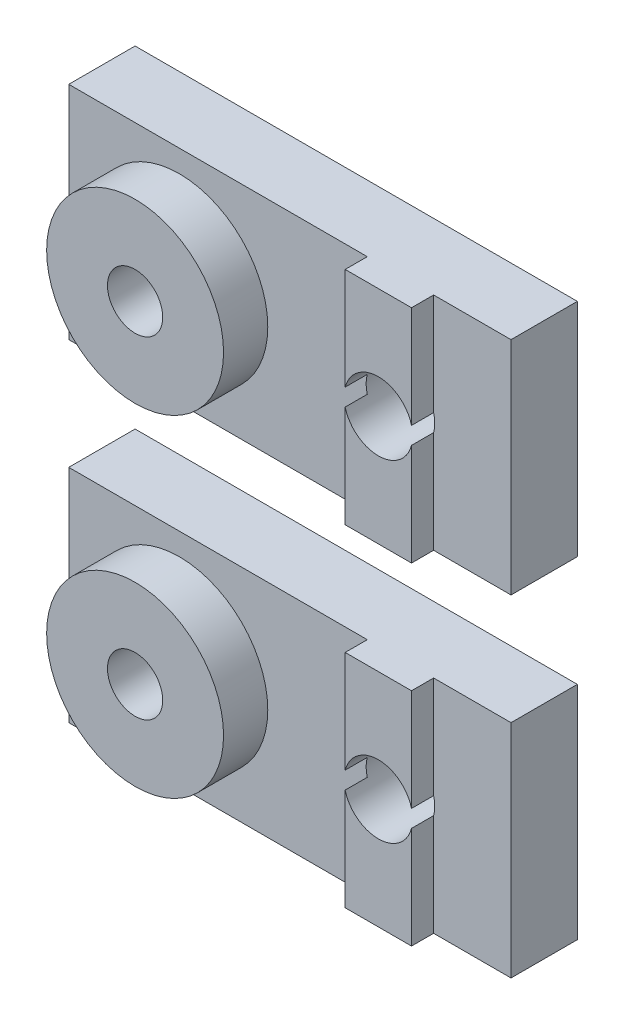
ISO-10303-21;
HEADER;
FILE_DESCRIPTION(('STEP AP214'),'2;1');
FILE_NAME('part.step','',(''),(''),'','','');
FILE_SCHEMA(('AUTOMOTIVE_DESIGN { 1 0 10303 214 1 1 1 1 }'));
ENDSEC;
DATA;
#1=APPLICATION_CONTEXT('core data for automotive mechanical design processes');
#2=APPLICATION_PROTOCOL_DEFINITION('international standard','automotive_design',2000,#1);
#3=PRODUCT_CONTEXT('',#1,'mechanical');
#4=PRODUCT('Part','Part','',(#3));
#5=PRODUCT_RELATED_PRODUCT_CATEGORY('part','',(#4));
#6=PRODUCT_DEFINITION_FORMATION('','',#4);
#7=PRODUCT_DEFINITION_CONTEXT('part definition',#1,'design');
#8=PRODUCT_DEFINITION('design','',#6,#7);
#9=PRODUCT_DEFINITION_SHAPE('','',#8);
#10=(LENGTH_UNIT() NAMED_UNIT(*) SI_UNIT(.MILLI.,.METRE.));
#11=(NAMED_UNIT(*) PLANE_ANGLE_UNIT() SI_UNIT($,.RADIAN.));
#12=(NAMED_UNIT(*) SI_UNIT($,.STERADIAN.) SOLID_ANGLE_UNIT());
#13=UNCERTAINTY_MEASURE_WITH_UNIT(LENGTH_MEASURE(1.E-05),#10,'distance_accuracy_value','');
#14=(GEOMETRIC_REPRESENTATION_CONTEXT(3) GLOBAL_UNCERTAINTY_ASSIGNED_CONTEXT((#13)) GLOBAL_UNIT_ASSIGNED_CONTEXT((#10,
#11,#12)) REPRESENTATION_CONTEXT('',''));
#15=CARTESIAN_POINT('',(0.,0.,0.));
#16=DIRECTION('',(0.,0.,1.));
#17=DIRECTION('',(1.,0.,0.));
#18=AXIS2_PLACEMENT_3D('',#15,#16,#17);
#19=CARTESIAN_POINT('',(3.5,25.,4.));
#20=DIRECTION('',(1.,0.,0.));
#21=DIRECTION('',(0.,1.,0.));
#22=AXIS2_PLACEMENT_3D('',#19,#20,#21);
#23=PLANE('',#22);
#24=DIRECTION('',(0.,0.,-1.));
#25=VECTOR('',#24,1.);
#26=CARTESIAN_POINT('',(3.5,19.6094875162047,5.));
#27=LINE('',#26,#25);
#28=CARTESIAN_POINT('',(3.5,19.6094875162047,3.));
#29=VERTEX_POINT('',#28);
#30=CARTESIAN_POINT('',(3.5,19.6094875162047,4.));
#31=VERTEX_POINT('',#30);
#32=EDGE_CURVE('E258',#29,#31,#27,.F.);
#33=ORIENTED_EDGE('',*,*,#32,.F.);
#34=DIRECTION('',(0.,-1.,0.));
#35=VECTOR('',#34,1.);
#36=CARTESIAN_POINT('',(3.5,25.,3.));
#37=LINE('',#36,#35);
#38=CARTESIAN_POINT('',(3.5,15.,3.));
#39=VERTEX_POINT('',#38);
#40=EDGE_CURVE('E169',#29,#39,#37,.T.);
#41=ORIENTED_EDGE('',*,*,#40,.T.);
#42=DIRECTION('',(0.,0.,-1.));
#43=VECTOR('',#42,1.);
#44=CARTESIAN_POINT('',(3.5,15.,4.));
#45=LINE('',#44,#43);
#46=CARTESIAN_POINT('',(3.5,15.,4.));
#47=VERTEX_POINT('',#46);
#48=EDGE_CURVE('E179',#47,#39,#45,.T.);
#49=ORIENTED_EDGE('',*,*,#48,.F.);
#50=DIRECTION('',(0.,-1.,0.));
#51=VECTOR('',#50,1.);
#52=CARTESIAN_POINT('',(3.5,25.,4.));
#53=LINE('',#52,#51);
#54=EDGE_CURVE('E154',#31,#47,#53,.T.);
#55=ORIENTED_EDGE('',*,*,#54,.F.);
#56=EDGE_LOOP('',(#33,#41,#49,#55));
#57=FACE_BOUND('',#56,.T.);
#58=ADVANCED_FACE('F43',(#57),#23,.F.);
#59=DIRECTION('',(0.,0.,-1.));
#60=VECTOR('',#59,1.);
#61=CARTESIAN_POINT('',(3.5,20.3905124837953,5.));
#62=LINE('',#61,#60);
#63=CARTESIAN_POINT('',(3.5,20.3905124837953,4.));
#64=VERTEX_POINT('',#63);
#65=CARTESIAN_POINT('',(3.5,20.3905124837953,3.));
#66=VERTEX_POINT('',#65);
#67=EDGE_CURVE('E133',#64,#66,#62,.T.);
#68=ORIENTED_EDGE('',*,*,#67,.F.);
#69=CARTESIAN_POINT('',(3.5,25.,4.));
#70=VERTEX_POINT('',#69);
#71=EDGE_CURVE('E144',#70,#64,#53,.T.);
#72=ORIENTED_EDGE('',*,*,#71,.F.);
#73=DIRECTION('',(0.,0.,-1.));
#74=VECTOR('',#73,1.);
#75=CARTESIAN_POINT('',(3.5,25.,4.));
#76=LINE('',#75,#74);
#77=CARTESIAN_POINT('',(3.5,25.,3.));
#78=VERTEX_POINT('',#77);
#79=EDGE_CURVE('E167',#70,#78,#76,.T.);
#80=ORIENTED_EDGE('',*,*,#79,.T.);
#81=EDGE_CURVE('E146',#78,#66,#37,.T.);
#82=ORIENTED_EDGE('',*,*,#81,.T.);
#83=EDGE_LOOP('',(#68,#72,#80,#82));
#84=FACE_BOUND('',#83,.T.);
#85=ADVANCED_FACE('F142',(#84),#23,.F.);
#86=CARTESIAN_POINT('',(6.5,25.,4.));
#87=DIRECTION('',(-1.,0.,0.));
#88=DIRECTION('',(0.,0.,1.));
#89=AXIS2_PLACEMENT_3D('',#86,#87,#88);
#90=PLANE('',#89);
#91=DIRECTION('',(0.,0.,-1.));
#92=VECTOR('',#91,1.);
#93=CARTESIAN_POINT('',(6.5,20.3905124837953,5.));
#94=LINE('',#93,#92);
#95=CARTESIAN_POINT('',(6.5,20.3905124837953,3.));
#96=VERTEX_POINT('',#95);
#97=CARTESIAN_POINT('',(6.5,20.3905124837953,4.));
#98=VERTEX_POINT('',#97);
#99=EDGE_CURVE('E58',#96,#98,#94,.F.);
#100=ORIENTED_EDGE('',*,*,#99,.F.);
#101=DIRECTION('',(0.,1.,0.));
#102=VECTOR('',#101,1.);
#103=CARTESIAN_POINT('',(6.5,25.,3.));
#104=LINE('',#103,#102);
#105=CARTESIAN_POINT('',(6.5,25.,3.));
#106=VERTEX_POINT('',#105);
#107=EDGE_CURVE('E65',#96,#106,#104,.T.);
#108=ORIENTED_EDGE('',*,*,#107,.T.);
#109=DIRECTION('',(0.,0.,-1.));
#110=VECTOR('',#109,1.);
#111=CARTESIAN_POINT('',(6.5,25.,4.));
#112=LINE('',#111,#110);
#113=CARTESIAN_POINT('',(6.5,25.,4.));
#114=VERTEX_POINT('',#113);
#115=EDGE_CURVE('E173',#114,#106,#112,.T.);
#116=ORIENTED_EDGE('',*,*,#115,.F.);
#117=DIRECTION('',(0.,1.,0.));
#118=VECTOR('',#117,1.);
#119=CARTESIAN_POINT('',(6.5,25.,4.));
#120=LINE('',#119,#118);
#121=EDGE_CURVE('E156',#98,#114,#120,.T.);
#122=ORIENTED_EDGE('',*,*,#121,.F.);
#123=EDGE_LOOP('',(#100,#108,#116,#122));
#124=FACE_BOUND('',#123,.T.);
#125=ADVANCED_FACE('F290',(#124),#90,.F.);
#126=DIRECTION('',(0.,0.,-1.));
#127=VECTOR('',#126,1.);
#128=CARTESIAN_POINT('',(6.5,19.6094875162047,5.));
#129=LINE('',#128,#127);
#130=CARTESIAN_POINT('',(6.5,19.6094875162047,4.));
#131=VERTEX_POINT('',#130);
#132=CARTESIAN_POINT('',(6.5,19.6094875162047,3.));
#133=VERTEX_POINT('',#132);
#134=EDGE_CURVE('E250',#131,#133,#129,.T.);
#135=ORIENTED_EDGE('',*,*,#134,.F.);
#136=CARTESIAN_POINT('',(6.5,15.,4.));
#137=VERTEX_POINT('',#136);
#138=EDGE_CURVE('E163',#137,#131,#120,.T.);
#139=ORIENTED_EDGE('',*,*,#138,.F.);
#140=DIRECTION('',(0.,0.,-1.));
#141=VECTOR('',#140,1.);
#142=CARTESIAN_POINT('',(6.5,15.,4.));
#143=LINE('',#142,#141);
#144=CARTESIAN_POINT('',(6.5,15.,3.));
#145=VERTEX_POINT('',#144);
#146=EDGE_CURVE('E176',#137,#145,#143,.T.);
#147=ORIENTED_EDGE('',*,*,#146,.T.);
#148=EDGE_CURVE('E158',#145,#133,#104,.T.);
#149=ORIENTED_EDGE('',*,*,#148,.T.);
#150=EDGE_LOOP('',(#135,#139,#147,#149));
#151=FACE_BOUND('',#150,.T.);
#152=ADVANCED_FACE('F249',(#151),#90,.F.);
#153=CARTESIAN_POINT('',(0.,15.,4.));
#154=DIRECTION('',(0.,0.,1.));
#155=DIRECTION('',(1.,0.,0.));
#156=AXIS2_PLACEMENT_3D('',#153,#154,#155);
#157=PLANE('',#156);
#158=ORIENTED_EDGE('',*,*,#138,.T.);
#159=CARTESIAN_POINT('',(5.,20.,4.));
#160=DIRECTION('',(0.,0.,1.));
#161=DIRECTION('',(1.,0.,0.));
#162=AXIS2_PLACEMENT_3D('',#159,#160,#161);
#163=CIRCLE('',#162,1.55);
#164=EDGE_CURVE('E12',#131,#31,#163,.F.);
#165=ORIENTED_EDGE('',*,*,#164,.T.);
#166=ORIENTED_EDGE('',*,*,#54,.T.);
#167=DIRECTION('',(1.,0.,0.));
#168=VECTOR('',#167,1.);
#169=CARTESIAN_POINT('',(3.5,15.,4.));
#170=LINE('',#169,#168);
#171=EDGE_CURVE('E153',#47,#137,#170,.T.);
#172=ORIENTED_EDGE('',*,*,#171,.T.);
#173=EDGE_LOOP('',(#158,#165,#166,#172));
#174=FACE_BOUND('',#173,.T.);
#175=ADVANCED_FACE('F252',(#174),#157,.T.);
#176=CARTESIAN_POINT('',(0.,15.,3.));
#177=DIRECTION('',(0.,0.,1.));
#178=DIRECTION('',(1.,0.,0.));
#179=AXIS2_PLACEMENT_3D('',#176,#177,#178);
#180=PLANE('',#179);
#181=CARTESIAN_POINT('',(-5.,20.,3.));
#182=DIRECTION('',(0.,0.,1.));
#183=DIRECTION('',(1.,0.,0.));
#184=AXIS2_PLACEMENT_3D('',#181,#182,#183);
#185=CIRCLE('',#184,4.);
#186=CARTESIAN_POINT('',(-1.,20.,3.));
#187=VERTEX_POINT('',#186);
#188=EDGE_CURVE('E185',#187,#187,#185,.T.);
#189=ORIENTED_EDGE('',*,*,#188,.F.);
#190=EDGE_LOOP('',(#189));
#191=FACE_BOUND('',#190,.T.);
#192=ORIENTED_EDGE('',*,*,#40,.F.);
#193=CARTESIAN_POINT('',(5.,20.,3.));
#194=DIRECTION('',(0.,0.,1.));
#195=DIRECTION('',(1.,0.,0.));
#196=AXIS2_PLACEMENT_3D('',#193,#194,#195);
#197=CIRCLE('',#196,1.55);
#198=EDGE_CURVE('E261',#29,#66,#197,.F.);
#199=ORIENTED_EDGE('',*,*,#198,.T.);
#200=ORIENTED_EDGE('',*,*,#81,.F.);
#201=DIRECTION('',(-1.,0.,0.));
#202=VECTOR('',#201,1.);
#203=CARTESIAN_POINT('',(-10.,25.,3.));
#204=LINE('',#203,#202);
#205=CARTESIAN_POINT('',(-10.,25.,3.));
#206=VERTEX_POINT('',#205);
#207=EDGE_CURVE('E202',#78,#206,#204,.T.);
#208=ORIENTED_EDGE('',*,*,#207,.T.);
#209=DIRECTION('',(0.,-1.,0.));
#210=VECTOR('',#209,1.);
#211=CARTESIAN_POINT('',(-10.,25.,3.));
#212=LINE('',#211,#210);
#213=CARTESIAN_POINT('',(-10.,15.,3.));
#214=VERTEX_POINT('',#213);
#215=EDGE_CURVE('E192',#206,#214,#212,.T.);
#216=ORIENTED_EDGE('',*,*,#215,.T.);
#217=DIRECTION('',(1.,0.,0.));
#218=VECTOR('',#217,1.);
#219=CARTESIAN_POINT('',(-10.,15.,3.));
#220=LINE('',#219,#218);
#221=EDGE_CURVE('E197',#214,#39,#220,.T.);
#222=ORIENTED_EDGE('',*,*,#221,.T.);
#223=EDGE_LOOP('',(#192,#199,#200,#208,#216,#222));
#224=FACE_BOUND('',#223,.T.);
#225=ADVANCED_FACE('F260',(#191,#224),#180,.T.);
#226=ORIENTED_EDGE('',*,*,#107,.F.);
#227=CARTESIAN_POINT('',(5.,20.,3.));
#228=DIRECTION('',(0.,0.,1.));
#229=DIRECTION('',(1.,0.,0.));
#230=AXIS2_PLACEMENT_3D('',#227,#228,#229);
#231=CIRCLE('',#230,1.55);
#232=EDGE_CURVE('E147',#96,#133,#231,.F.);
#233=ORIENTED_EDGE('',*,*,#232,.T.);
#234=ORIENTED_EDGE('',*,*,#148,.F.);
#235=CARTESIAN_POINT('',(10.,15.,3.));
#236=VERTEX_POINT('',#235);
#237=EDGE_CURVE('E195',#145,#236,#220,.T.);
#238=ORIENTED_EDGE('',*,*,#237,.T.);
#239=DIRECTION('',(0.,1.,0.));
#240=VECTOR('',#239,1.);
#241=CARTESIAN_POINT('',(10.,25.,3.));
#242=LINE('',#241,#240);
#243=CARTESIAN_POINT('',(10.,25.,3.));
#244=VERTEX_POINT('',#243);
#245=EDGE_CURVE('E200',#236,#244,#242,.T.);
#246=ORIENTED_EDGE('',*,*,#245,.T.);
#247=EDGE_CURVE('E203',#244,#106,#204,.T.);
#248=ORIENTED_EDGE('',*,*,#247,.T.);
#249=EDGE_LOOP('',(#226,#233,#234,#238,#246,#248));
#250=FACE_BOUND('',#249,.T.);
#251=ADVANCED_FACE('F241',(#250),#180,.T.);
#252=CARTESIAN_POINT('',(-10.,25.,3.));
#253=DIRECTION('',(1.,0.,0.));
#254=DIRECTION('',(0.,1.,0.));
#255=AXIS2_PLACEMENT_3D('',#252,#253,#254);
#256=PLANE('',#255);
#257=DIRECTION('',(0.,-1.,0.));
#258=VECTOR('',#257,1.);
#259=CARTESIAN_POINT('',(-10.,25.,0.));
#260=LINE('',#259,#258);
#261=CARTESIAN_POINT('',(-10.,25.,0.));
#262=VERTEX_POINT('',#261);
#263=CARTESIAN_POINT('',(-10.,15.,0.));
#264=VERTEX_POINT('',#263);
#265=EDGE_CURVE('E189',#262,#264,#260,.T.);
#266=ORIENTED_EDGE('',*,*,#265,.T.);
#267=DIRECTION('',(0.,0.,-1.));
#268=VECTOR('',#267,1.);
#269=CARTESIAN_POINT('',(-10.,15.,3.));
#270=LINE('',#269,#268);
#271=EDGE_CURVE('E138',#214,#264,#270,.T.);
#272=ORIENTED_EDGE('',*,*,#271,.F.);
#273=ORIENTED_EDGE('',*,*,#215,.F.);
#274=DIRECTION('',(0.,0.,-1.));
#275=VECTOR('',#274,1.);
#276=CARTESIAN_POINT('',(-10.,25.,3.));
#277=LINE('',#276,#275);
#278=EDGE_CURVE('E205',#206,#262,#277,.T.);
#279=ORIENTED_EDGE('',*,*,#278,.T.);
#280=EDGE_LOOP('',(#266,#272,#273,#279));
#281=FACE_BOUND('',#280,.T.);
#282=ADVANCED_FACE('F45',(#281),#256,.F.);
#283=CARTESIAN_POINT('',(-10.,15.,3.));
#284=DIRECTION('',(0.,1.,0.));
#285=DIRECTION('',(-1.,0.,0.));
#286=AXIS2_PLACEMENT_3D('',#283,#284,#285);
#287=PLANE('',#286);
#288=DIRECTION('',(1.,0.,0.));
#289=VECTOR('',#288,1.);
#290=CARTESIAN_POINT('',(-10.,15.,0.));
#291=LINE('',#290,#289);
#292=CARTESIAN_POINT('',(10.,15.,0.));
#293=VERTEX_POINT('',#292);
#294=EDGE_CURVE('E208',#264,#293,#291,.T.);
#295=ORIENTED_EDGE('',*,*,#294,.T.);
#296=DIRECTION('',(0.,0.,-1.));
#297=VECTOR('',#296,1.);
#298=CARTESIAN_POINT('',(10.,15.,3.));
#299=LINE('',#298,#297);
#300=EDGE_CURVE('E218',#236,#293,#299,.T.);
#301=ORIENTED_EDGE('',*,*,#300,.F.);
#302=ORIENTED_EDGE('',*,*,#237,.F.);
#303=ORIENTED_EDGE('',*,*,#146,.F.);
#304=ORIENTED_EDGE('',*,*,#171,.F.);
#305=ORIENTED_EDGE('',*,*,#48,.T.);
#306=ORIENTED_EDGE('',*,*,#221,.F.);
#307=ORIENTED_EDGE('',*,*,#271,.T.);
#308=EDGE_LOOP('',(#295,#301,#302,#303,#304,#305,#306,#307));
#309=FACE_BOUND('',#308,.T.);
#310=ADVANCED_FACE('F223',(#309),#287,.F.);
#311=CARTESIAN_POINT('',(10.,25.,3.));
#312=DIRECTION('',(-1.,0.,0.));
#313=DIRECTION('',(0.,0.,1.));
#314=AXIS2_PLACEMENT_3D('',#311,#312,#313);
#315=PLANE('',#314);
#316=DIRECTION('',(0.,1.,0.));
#317=VECTOR('',#316,1.);
#318=CARTESIAN_POINT('',(10.,25.,0.));
#319=LINE('',#318,#317);
#320=CARTESIAN_POINT('',(10.,25.,0.));
#321=VERTEX_POINT('',#320);
#322=EDGE_CURVE('E210',#293,#321,#319,.T.);
#323=ORIENTED_EDGE('',*,*,#322,.T.);
#324=DIRECTION('',(0.,0.,-1.));
#325=VECTOR('',#324,1.);
#326=CARTESIAN_POINT('',(10.,25.,3.));
#327=LINE('',#326,#325);
#328=EDGE_CURVE('E215',#244,#321,#327,.T.);
#329=ORIENTED_EDGE('',*,*,#328,.F.);
#330=ORIENTED_EDGE('',*,*,#245,.F.);
#331=ORIENTED_EDGE('',*,*,#300,.T.);
#332=EDGE_LOOP('',(#323,#329,#330,#331));
#333=FACE_BOUND('',#332,.T.);
#334=ADVANCED_FACE('F235',(#333),#315,.F.);
#335=CARTESIAN_POINT('',(-10.,25.,3.));
#336=DIRECTION('',(0.,-1.,0.));
#337=DIRECTION('',(1.,0.,0.));
#338=AXIS2_PLACEMENT_3D('',#335,#336,#337);
#339=PLANE('',#338);
#340=DIRECTION('',(-1.,0.,0.));
#341=VECTOR('',#340,1.);
#342=CARTESIAN_POINT('',(-10.,25.,0.));
#343=LINE('',#342,#341);
#344=EDGE_CURVE('E196',#321,#262,#343,.T.);
#345=ORIENTED_EDGE('',*,*,#344,.T.);
#346=ORIENTED_EDGE('',*,*,#278,.F.);
#347=ORIENTED_EDGE('',*,*,#207,.F.);
#348=ORIENTED_EDGE('',*,*,#79,.F.);
#349=DIRECTION('',(-1.,0.,0.));
#350=VECTOR('',#349,1.);
#351=CARTESIAN_POINT('',(3.5,25.,4.));
#352=LINE('',#351,#350);
#353=EDGE_CURVE('E151',#114,#70,#352,.T.);
#354=ORIENTED_EDGE('',*,*,#353,.F.);
#355=ORIENTED_EDGE('',*,*,#115,.T.);
#356=ORIENTED_EDGE('',*,*,#247,.F.);
#357=ORIENTED_EDGE('',*,*,#328,.T.);
#358=EDGE_LOOP('',(#345,#346,#347,#348,#354,#355,#356,#357));
#359=FACE_BOUND('',#358,.T.);
#360=ADVANCED_FACE('F239',(#359),#339,.F.);
#361=CARTESIAN_POINT('',(0.,15.,0.));
#362=DIRECTION('',(0.,0.,1.));
#363=DIRECTION('',(1.,0.,0.));
#364=AXIS2_PLACEMENT_3D('',#361,#362,#363);
#365=PLANE('',#364);
#366=CARTESIAN_POINT('',(5.,20.,0.));
#367=DIRECTION('',(0.,0.,1.));
#368=DIRECTION('',(1.,0.,0.));
#369=AXIS2_PLACEMENT_3D('',#366,#367,#368);
#370=CIRCLE('',#369,1.55);
#371=CARTESIAN_POINT('',(6.55,20.,0.));
#372=VERTEX_POINT('',#371);
#373=EDGE_CURVE('E417',#372,#372,#370,.T.);
#374=ORIENTED_EDGE('',*,*,#373,.T.);
#375=EDGE_LOOP('',(#374));
#376=FACE_BOUND('',#375,.T.);
#377=CARTESIAN_POINT('',(-5.,20.,0.));
#378=DIRECTION('',(0.,0.,1.));
#379=DIRECTION('',(1.,0.,0.));
#380=AXIS2_PLACEMENT_3D('',#377,#378,#379);
#381=CIRCLE('',#380,1.25);
#382=CARTESIAN_POINT('',(-3.75,20.,0.));
#383=VERTEX_POINT('',#382);
#384=EDGE_CURVE('E160',#383,#383,#381,.T.);
#385=ORIENTED_EDGE('',*,*,#384,.T.);
#386=EDGE_LOOP('',(#385));
#387=FACE_BOUND('',#386,.T.);
#388=ORIENTED_EDGE('',*,*,#265,.F.);
#389=ORIENTED_EDGE('',*,*,#344,.F.);
#390=ORIENTED_EDGE('',*,*,#322,.F.);
#391=ORIENTED_EDGE('',*,*,#294,.F.);
#392=EDGE_LOOP('',(#388,#389,#390,#391));
#393=FACE_BOUND('',#392,.T.);
#394=ADVANCED_FACE('F231',(#376,#387,#393),#365,.F.);
#395=CARTESIAN_POINT('',(-5.,20.,5.));
#396=DIRECTION('',(0.,0.,1.));
#397=DIRECTION('',(1.,0.,0.));
#398=AXIS2_PLACEMENT_3D('',#395,#396,#397);
#399=PLANE('',#398);
#400=CARTESIAN_POINT('',(-5.,20.,5.));
#401=DIRECTION('',(0.,0.,1.));
#402=DIRECTION('',(1.,0.,0.));
#403=AXIS2_PLACEMENT_3D('',#400,#401,#402);
#404=CIRCLE('',#403,4.);
#405=CARTESIAN_POINT('',(-1.,20.,5.));
#406=VERTEX_POINT('',#405);
#407=EDGE_CURVE('E186',#406,#406,#404,.T.);
#408=ORIENTED_EDGE('',*,*,#407,.T.);
#409=EDGE_LOOP('',(#408));
#410=FACE_BOUND('',#409,.T.);
#411=CARTESIAN_POINT('',(-5.,20.,5.));
#412=DIRECTION('',(0.,0.,1.));
#413=DIRECTION('',(1.,0.,0.));
#414=AXIS2_PLACEMENT_3D('',#411,#412,#413);
#415=CIRCLE('',#414,1.25);
#416=CARTESIAN_POINT('',(-3.75,20.,5.));
#417=VERTEX_POINT('',#416);
#418=EDGE_CURVE('E182',#417,#417,#415,.T.);
#419=ORIENTED_EDGE('',*,*,#418,.F.);
#420=EDGE_LOOP('',(#419));
#421=FACE_BOUND('',#420,.T.);
#422=ADVANCED_FACE('F280',(#410,#421),#399,.T.);
#423=CARTESIAN_POINT('',(-5.,20.,5.));
#424=DIRECTION('',(0.,0.,-1.));
#425=DIRECTION('',(-1.,0.,0.));
#426=AXIS2_PLACEMENT_3D('',#423,#424,#425);
#427=CYLINDRICAL_SURFACE('',#426,4.);
#428=ORIENTED_EDGE('',*,*,#407,.F.);
#429=EDGE_LOOP('',(#428));
#430=FACE_BOUND('',#429,.T.);
#431=ORIENTED_EDGE('',*,*,#188,.T.);
#432=EDGE_LOOP('',(#431));
#433=FACE_BOUND('',#432,.T.);
#434=ADVANCED_FACE('F271',(#430,#433),#427,.T.);
#435=CARTESIAN_POINT('',(-5.,20.,5.));
#436=DIRECTION('',(0.,0.,-1.));
#437=DIRECTION('',(-1.,0.,0.));
#438=AXIS2_PLACEMENT_3D('',#435,#436,#437);
#439=CYLINDRICAL_SURFACE('',#438,1.25);
#440=ORIENTED_EDGE('',*,*,#418,.T.);
#441=EDGE_LOOP('',(#440));
#442=FACE_BOUND('',#441,.T.);
#443=ORIENTED_EDGE('',*,*,#384,.F.);
#444=EDGE_LOOP('',(#443));
#445=FACE_BOUND('',#444,.T.);
#446=ADVANCED_FACE('F269',(#442,#445),#439,.F.);
#447=ORIENTED_EDGE('',*,*,#71,.T.);
#448=EDGE_CURVE('E47',#64,#98,#163,.F.);
#449=ORIENTED_EDGE('',*,*,#448,.T.);
#450=ORIENTED_EDGE('',*,*,#121,.T.);
#451=ORIENTED_EDGE('',*,*,#353,.T.);
#452=EDGE_LOOP('',(#447,#449,#450,#451));
#453=FACE_BOUND('',#452,.T.);
#454=ADVANCED_FACE('F149',(#453),#157,.T.);
#455=CARTESIAN_POINT('',(5.,20.,5.));
#456=DIRECTION('',(0.,0.,-1.));
#457=DIRECTION('',(-1.,0.,0.));
#458=AXIS2_PLACEMENT_3D('',#455,#456,#457);
#459=CYLINDRICAL_SURFACE('',#458,1.55);
#460=ORIENTED_EDGE('',*,*,#134,.T.);
#461=ORIENTED_EDGE('',*,*,#232,.F.);
#462=ORIENTED_EDGE('',*,*,#99,.T.);
#463=ORIENTED_EDGE('',*,*,#448,.F.);
#464=ORIENTED_EDGE('',*,*,#67,.T.);
#465=ORIENTED_EDGE('',*,*,#198,.F.);
#466=ORIENTED_EDGE('',*,*,#32,.T.);
#467=ORIENTED_EDGE('',*,*,#164,.F.);
#468=EDGE_LOOP('',(#460,#461,#462,#463,#464,#465,#466,#467));
#469=FACE_BOUND('',#468,.T.);
#470=ORIENTED_EDGE('',*,*,#373,.F.);
#471=EDGE_LOOP('',(#470));
#472=FACE_BOUND('',#471,.T.);
#473=ADVANCED_FACE('F131',(#469,#472),#459,.F.);
#474=CLOSED_SHELL('',(#58,#85,#125,#152,#175,#225,#251,#282,#310,#334,#360,#394,#422,#434,#446,
#454,#473));
#475=MANIFOLD_SOLID_BREP('B2',#474);
#476=CARTESIAN_POINT('',(3.5,10.,4.));
#477=DIRECTION('',(1.,0.,0.));
#478=DIRECTION('',(0.,1.,0.));
#479=AXIS2_PLACEMENT_3D('',#476,#477,#478);
#480=PLANE('',#479);
#481=DIRECTION('',(0.,0.,-1.));
#482=VECTOR('',#481,1.);
#483=CARTESIAN_POINT('',(3.5,4.60948751620466,5.));
#484=LINE('',#483,#482);
#485=CARTESIAN_POINT('',(3.5,4.60948751620466,3.));
#486=VERTEX_POINT('',#485);
#487=CARTESIAN_POINT('',(3.5,4.60948751620466,4.));
#488=VERTEX_POINT('',#487);
#489=EDGE_CURVE('E645',#486,#488,#484,.F.);
#490=ORIENTED_EDGE('',*,*,#489,.F.);
#491=DIRECTION('',(0.,-1.,0.));
#492=VECTOR('',#491,1.);
#493=CARTESIAN_POINT('',(3.5,10.,3.));
#494=LINE('',#493,#492);
#495=CARTESIAN_POINT('',(3.5,0.,3.));
#496=VERTEX_POINT('',#495);
#497=EDGE_CURVE('E556',#486,#496,#494,.T.);
#498=ORIENTED_EDGE('',*,*,#497,.T.);
#499=DIRECTION('',(0.,0.,-1.));
#500=VECTOR('',#499,1.);
#501=CARTESIAN_POINT('',(3.5,0.,4.));
#502=LINE('',#501,#500);
#503=CARTESIAN_POINT('',(3.5,0.,4.));
#504=VERTEX_POINT('',#503);
#505=EDGE_CURVE('E566',#504,#496,#502,.T.);
#506=ORIENTED_EDGE('',*,*,#505,.F.);
#507=DIRECTION('',(0.,-1.,0.));
#508=VECTOR('',#507,1.);
#509=CARTESIAN_POINT('',(3.5,10.,4.));
#510=LINE('',#509,#508);
#511=EDGE_CURVE('E541',#488,#504,#510,.T.);
#512=ORIENTED_EDGE('',*,*,#511,.F.);
#513=EDGE_LOOP('',(#490,#498,#506,#512));
#514=FACE_BOUND('',#513,.T.);
#515=ADVANCED_FACE('F430',(#514),#480,.F.);
#516=DIRECTION('',(0.,0.,-1.));
#517=VECTOR('',#516,1.);
#518=CARTESIAN_POINT('',(3.5,5.39051248379534,5.));
#519=LINE('',#518,#517);
#520=CARTESIAN_POINT('',(3.5,5.39051248379534,4.));
#521=VERTEX_POINT('',#520);
#522=CARTESIAN_POINT('',(3.5,5.39051248379534,3.));
#523=VERTEX_POINT('',#522);
#524=EDGE_CURVE('E520',#521,#523,#519,.T.);
#525=ORIENTED_EDGE('',*,*,#524,.F.);
#526=CARTESIAN_POINT('',(3.5,10.,4.));
#527=VERTEX_POINT('',#526);
#528=EDGE_CURVE('E531',#527,#521,#510,.T.);
#529=ORIENTED_EDGE('',*,*,#528,.F.);
#530=DIRECTION('',(0.,0.,-1.));
#531=VECTOR('',#530,1.);
#532=CARTESIAN_POINT('',(3.5,10.,4.));
#533=LINE('',#532,#531);
#534=CARTESIAN_POINT('',(3.5,10.,3.));
#535=VERTEX_POINT('',#534);
#536=EDGE_CURVE('E554',#527,#535,#533,.T.);
#537=ORIENTED_EDGE('',*,*,#536,.T.);
#538=EDGE_CURVE('E533',#535,#523,#494,.T.);
#539=ORIENTED_EDGE('',*,*,#538,.T.);
#540=EDGE_LOOP('',(#525,#529,#537,#539));
#541=FACE_BOUND('',#540,.T.);
#542=ADVANCED_FACE('F529',(#541),#480,.F.);
#543=CARTESIAN_POINT('',(6.5,10.,4.));
#544=DIRECTION('',(-1.,0.,0.));
#545=DIRECTION('',(0.,0.,1.));
#546=AXIS2_PLACEMENT_3D('',#543,#544,#545);
#547=PLANE('',#546);
#548=DIRECTION('',(0.,0.,-1.));
#549=VECTOR('',#548,1.);
#550=CARTESIAN_POINT('',(6.5,5.39051248379533,5.));
#551=LINE('',#550,#549);
#552=CARTESIAN_POINT('',(6.5,5.39051248379533,3.));
#553=VERTEX_POINT('',#552);
#554=CARTESIAN_POINT('',(6.5,5.39051248379533,4.));
#555=VERTEX_POINT('',#554);
#556=EDGE_CURVE('E445',#553,#555,#551,.F.);
#557=ORIENTED_EDGE('',*,*,#556,.F.);
#558=DIRECTION('',(0.,1.,0.));
#559=VECTOR('',#558,1.);
#560=CARTESIAN_POINT('',(6.5,10.,3.));
#561=LINE('',#560,#559);
#562=CARTESIAN_POINT('',(6.5,10.,3.));
#563=VERTEX_POINT('',#562);
#564=EDGE_CURVE('E452',#553,#563,#561,.T.);
#565=ORIENTED_EDGE('',*,*,#564,.T.);
#566=DIRECTION('',(0.,0.,-1.));
#567=VECTOR('',#566,1.);
#568=CARTESIAN_POINT('',(6.5,10.,4.));
#569=LINE('',#568,#567);
#570=CARTESIAN_POINT('',(6.5,10.,4.));
#571=VERTEX_POINT('',#570);
#572=EDGE_CURVE('E560',#571,#563,#569,.T.);
#573=ORIENTED_EDGE('',*,*,#572,.F.);
#574=DIRECTION('',(0.,1.,0.));
#575=VECTOR('',#574,1.);
#576=CARTESIAN_POINT('',(6.5,10.,4.));
#577=LINE('',#576,#575);
#578=EDGE_CURVE('E543',#555,#571,#577,.T.);
#579=ORIENTED_EDGE('',*,*,#578,.F.);
#580=EDGE_LOOP('',(#557,#565,#573,#579));
#581=FACE_BOUND('',#580,.T.);
#582=ADVANCED_FACE('F677',(#581),#547,.F.);
#583=DIRECTION('',(0.,0.,-1.));
#584=VECTOR('',#583,1.);
#585=CARTESIAN_POINT('',(6.5,4.60948751620467,5.));
#586=LINE('',#585,#584);
#587=CARTESIAN_POINT('',(6.5,4.60948751620467,4.));
#588=VERTEX_POINT('',#587);
#589=CARTESIAN_POINT('',(6.5,4.60948751620467,3.));
#590=VERTEX_POINT('',#589);
#591=EDGE_CURVE('E637',#588,#590,#586,.T.);
#592=ORIENTED_EDGE('',*,*,#591,.F.);
#593=CARTESIAN_POINT('',(6.5,0.,4.));
#594=VERTEX_POINT('',#593);
#595=EDGE_CURVE('E550',#594,#588,#577,.T.);
#596=ORIENTED_EDGE('',*,*,#595,.F.);
#597=DIRECTION('',(0.,0.,-1.));
#598=VECTOR('',#597,1.);
#599=CARTESIAN_POINT('',(6.5,0.,4.));
#600=LINE('',#599,#598);
#601=CARTESIAN_POINT('',(6.5,0.,3.));
#602=VERTEX_POINT('',#601);
#603=EDGE_CURVE('E563',#594,#602,#600,.T.);
#604=ORIENTED_EDGE('',*,*,#603,.T.);
#605=EDGE_CURVE('E545',#602,#590,#561,.T.);
#606=ORIENTED_EDGE('',*,*,#605,.T.);
#607=EDGE_LOOP('',(#592,#596,#604,#606));
#608=FACE_BOUND('',#607,.T.);
#609=ADVANCED_FACE('F636',(#608),#547,.F.);
#610=CARTESIAN_POINT('',(0.,0.,4.));
#611=DIRECTION('',(0.,0.,1.));
#612=DIRECTION('',(1.,0.,0.));
#613=AXIS2_PLACEMENT_3D('',#610,#611,#612);
#614=PLANE('',#613);
#615=ORIENTED_EDGE('',*,*,#595,.T.);
#616=CARTESIAN_POINT('',(5.,5.,4.));
#617=DIRECTION('',(0.,0.,1.));
#618=DIRECTION('',(1.,0.,0.));
#619=AXIS2_PLACEMENT_3D('',#616,#617,#618);
#620=CIRCLE('',#619,1.55);
#621=EDGE_CURVE('E41',#588,#488,#620,.F.);
#622=ORIENTED_EDGE('',*,*,#621,.T.);
#623=ORIENTED_EDGE('',*,*,#511,.T.);
#624=DIRECTION('',(1.,0.,0.));
#625=VECTOR('',#624,1.);
#626=CARTESIAN_POINT('',(3.5,0.,4.));
#627=LINE('',#626,#625);
#628=EDGE_CURVE('E540',#504,#594,#627,.T.);
#629=ORIENTED_EDGE('',*,*,#628,.T.);
#630=EDGE_LOOP('',(#615,#622,#623,#629));
#631=FACE_BOUND('',#630,.T.);
#632=ADVANCED_FACE('F639',(#631),#614,.T.);
#633=CARTESIAN_POINT('',(0.,0.,3.));
#634=DIRECTION('',(0.,0.,1.));
#635=DIRECTION('',(1.,0.,0.));
#636=AXIS2_PLACEMENT_3D('',#633,#634,#635);
#637=PLANE('',#636);
#638=CARTESIAN_POINT('',(-5.,5.,3.));
#639=DIRECTION('',(0.,0.,1.));
#640=DIRECTION('',(1.,0.,0.));
#641=AXIS2_PLACEMENT_3D('',#638,#639,#640);
#642=CIRCLE('',#641,4.);
#643=CARTESIAN_POINT('',(-1.,5.,3.));
#644=VERTEX_POINT('',#643);
#645=EDGE_CURVE('E572',#644,#644,#642,.T.);
#646=ORIENTED_EDGE('',*,*,#645,.F.);
#647=EDGE_LOOP('',(#646));
#648=FACE_BOUND('',#647,.T.);
#649=ORIENTED_EDGE('',*,*,#497,.F.);
#650=CARTESIAN_POINT('',(5.,5.,3.));
#651=DIRECTION('',(0.,0.,1.));
#652=DIRECTION('',(1.,0.,0.));
#653=AXIS2_PLACEMENT_3D('',#650,#651,#652);
#654=CIRCLE('',#653,1.55);
#655=EDGE_CURVE('E648',#486,#523,#654,.F.);
#656=ORIENTED_EDGE('',*,*,#655,.T.);
#657=ORIENTED_EDGE('',*,*,#538,.F.);
#658=DIRECTION('',(-1.,0.,0.));
#659=VECTOR('',#658,1.);
#660=CARTESIAN_POINT('',(-10.,10.,3.));
#661=LINE('',#660,#659);
#662=CARTESIAN_POINT('',(-10.,10.,3.));
#663=VERTEX_POINT('',#662);
#664=EDGE_CURVE('E589',#535,#663,#661,.T.);
#665=ORIENTED_EDGE('',*,*,#664,.T.);
#666=DIRECTION('',(0.,-1.,0.));
#667=VECTOR('',#666,1.);
#668=CARTESIAN_POINT('',(-10.,10.,3.));
#669=LINE('',#668,#667);
#670=CARTESIAN_POINT('',(-10.,0.,3.));
#671=VERTEX_POINT('',#670);
#672=EDGE_CURVE('E579',#663,#671,#669,.T.);
#673=ORIENTED_EDGE('',*,*,#672,.T.);
#674=DIRECTION('',(1.,0.,0.));
#675=VECTOR('',#674,1.);
#676=CARTESIAN_POINT('',(-10.,0.,3.));
#677=LINE('',#676,#675);
#678=EDGE_CURVE('E584',#671,#496,#677,.T.);
#679=ORIENTED_EDGE('',*,*,#678,.T.);
#680=EDGE_LOOP('',(#649,#656,#657,#665,#673,#679));
#681=FACE_BOUND('',#680,.T.);
#682=ADVANCED_FACE('F647',(#648,#681),#637,.T.);
#683=ORIENTED_EDGE('',*,*,#564,.F.);
#684=CARTESIAN_POINT('',(5.,5.,3.));
#685=DIRECTION('',(0.,0.,1.));
#686=DIRECTION('',(1.,0.,0.));
#687=AXIS2_PLACEMENT_3D('',#684,#685,#686);
#688=CIRCLE('',#687,1.55);
#689=EDGE_CURVE('E534',#553,#590,#688,.F.);
#690=ORIENTED_EDGE('',*,*,#689,.T.);
#691=ORIENTED_EDGE('',*,*,#605,.F.);
#692=CARTESIAN_POINT('',(10.,0.,3.));
#693=VERTEX_POINT('',#692);
#694=EDGE_CURVE('E582',#602,#693,#677,.T.);
#695=ORIENTED_EDGE('',*,*,#694,.T.);
#696=DIRECTION('',(0.,1.,0.));
#697=VECTOR('',#696,1.);
#698=CARTESIAN_POINT('',(10.,10.,3.));
#699=LINE('',#698,#697);
#700=CARTESIAN_POINT('',(10.,10.,3.));
#701=VERTEX_POINT('',#700);
#702=EDGE_CURVE('E587',#693,#701,#699,.T.);
#703=ORIENTED_EDGE('',*,*,#702,.T.);
#704=EDGE_CURVE('E590',#701,#563,#661,.T.);
#705=ORIENTED_EDGE('',*,*,#704,.T.);
#706=EDGE_LOOP('',(#683,#690,#691,#695,#703,#705));
#707=FACE_BOUND('',#706,.T.);
#708=ADVANCED_FACE('F628',(#707),#637,.T.);
#709=CARTESIAN_POINT('',(-10.,10.,3.));
#710=DIRECTION('',(1.,0.,0.));
#711=DIRECTION('',(0.,1.,0.));
#712=AXIS2_PLACEMENT_3D('',#709,#710,#711);
#713=PLANE('',#712);
#714=DIRECTION('',(0.,-1.,0.));
#715=VECTOR('',#714,1.);
#716=CARTESIAN_POINT('',(-10.,10.,0.));
#717=LINE('',#716,#715);
#718=CARTESIAN_POINT('',(-10.,10.,0.));
#719=VERTEX_POINT('',#718);
#720=CARTESIAN_POINT('',(-10.,0.,0.));
#721=VERTEX_POINT('',#720);
#722=EDGE_CURVE('E576',#719,#721,#717,.T.);
#723=ORIENTED_EDGE('',*,*,#722,.T.);
#724=DIRECTION('',(0.,0.,-1.));
#725=VECTOR('',#724,1.);
#726=CARTESIAN_POINT('',(-10.,0.,3.));
#727=LINE('',#726,#725);
#728=EDGE_CURVE('E525',#671,#721,#727,.T.);
#729=ORIENTED_EDGE('',*,*,#728,.F.);
#730=ORIENTED_EDGE('',*,*,#672,.F.);
#731=DIRECTION('',(0.,0.,-1.));
#732=VECTOR('',#731,1.);
#733=CARTESIAN_POINT('',(-10.,10.,3.));
#734=LINE('',#733,#732);
#735=EDGE_CURVE('E592',#663,#719,#734,.T.);
#736=ORIENTED_EDGE('',*,*,#735,.T.);
#737=EDGE_LOOP('',(#723,#729,#730,#736));
#738=FACE_BOUND('',#737,.T.);
#739=ADVANCED_FACE('F432',(#738),#713,.F.);
#740=CARTESIAN_POINT('',(-10.,0.,3.));
#741=DIRECTION('',(0.,1.,0.));
#742=DIRECTION('',(-1.,0.,0.));
#743=AXIS2_PLACEMENT_3D('',#740,#741,#742);
#744=PLANE('',#743);
#745=DIRECTION('',(1.,0.,0.));
#746=VECTOR('',#745,1.);
#747=CARTESIAN_POINT('',(-10.,0.,0.));
#748=LINE('',#747,#746);
#749=CARTESIAN_POINT('',(10.,0.,0.));
#750=VERTEX_POINT('',#749);
#751=EDGE_CURVE('E595',#721,#750,#748,.T.);
#752=ORIENTED_EDGE('',*,*,#751,.T.);
#753=DIRECTION('',(0.,0.,-1.));
#754=VECTOR('',#753,1.);
#755=CARTESIAN_POINT('',(10.,0.,3.));
#756=LINE('',#755,#754);
#757=EDGE_CURVE('E605',#693,#750,#756,.T.);
#758=ORIENTED_EDGE('',*,*,#757,.F.);
#759=ORIENTED_EDGE('',*,*,#694,.F.);
#760=ORIENTED_EDGE('',*,*,#603,.F.);
#761=ORIENTED_EDGE('',*,*,#628,.F.);
#762=ORIENTED_EDGE('',*,*,#505,.T.);
#763=ORIENTED_EDGE('',*,*,#678,.F.);
#764=ORIENTED_EDGE('',*,*,#728,.T.);
#765=EDGE_LOOP('',(#752,#758,#759,#760,#761,#762,#763,#764));
#766=FACE_BOUND('',#765,.T.);
#767=ADVANCED_FACE('F610',(#766),#744,.F.);
#768=CARTESIAN_POINT('',(10.,10.,3.));
#769=DIRECTION('',(-1.,0.,0.));
#770=DIRECTION('',(0.,0.,1.));
#771=AXIS2_PLACEMENT_3D('',#768,#769,#770);
#772=PLANE('',#771);
#773=DIRECTION('',(0.,1.,0.));
#774=VECTOR('',#773,1.);
#775=CARTESIAN_POINT('',(10.,10.,0.));
#776=LINE('',#775,#774);
#777=CARTESIAN_POINT('',(10.,10.,0.));
#778=VERTEX_POINT('',#777);
#779=EDGE_CURVE('E597',#750,#778,#776,.T.);
#780=ORIENTED_EDGE('',*,*,#779,.T.);
#781=DIRECTION('',(0.,0.,-1.));
#782=VECTOR('',#781,1.);
#783=CARTESIAN_POINT('',(10.,10.,3.));
#784=LINE('',#783,#782);
#785=EDGE_CURVE('E602',#701,#778,#784,.T.);
#786=ORIENTED_EDGE('',*,*,#785,.F.);
#787=ORIENTED_EDGE('',*,*,#702,.F.);
#788=ORIENTED_EDGE('',*,*,#757,.T.);
#789=EDGE_LOOP('',(#780,#786,#787,#788));
#790=FACE_BOUND('',#789,.T.);
#791=ADVANCED_FACE('F622',(#790),#772,.F.);
#792=CARTESIAN_POINT('',(-10.,10.,3.));
#793=DIRECTION('',(0.,-1.,0.));
#794=DIRECTION('',(1.,0.,0.));
#795=AXIS2_PLACEMENT_3D('',#792,#793,#794);
#796=PLANE('',#795);
#797=DIRECTION('',(-1.,0.,0.));
#798=VECTOR('',#797,1.);
#799=CARTESIAN_POINT('',(-10.,10.,0.));
#800=LINE('',#799,#798);
#801=EDGE_CURVE('E583',#778,#719,#800,.T.);
#802=ORIENTED_EDGE('',*,*,#801,.T.);
#803=ORIENTED_EDGE('',*,*,#735,.F.);
#804=ORIENTED_EDGE('',*,*,#664,.F.);
#805=ORIENTED_EDGE('',*,*,#536,.F.);
#806=DIRECTION('',(-1.,0.,0.));
#807=VECTOR('',#806,1.);
#808=CARTESIAN_POINT('',(3.5,10.,4.));
#809=LINE('',#808,#807);
#810=EDGE_CURVE('E538',#571,#527,#809,.T.);
#811=ORIENTED_EDGE('',*,*,#810,.F.);
#812=ORIENTED_EDGE('',*,*,#572,.T.);
#813=ORIENTED_EDGE('',*,*,#704,.F.);
#814=ORIENTED_EDGE('',*,*,#785,.T.);
#815=EDGE_LOOP('',(#802,#803,#804,#805,#811,#812,#813,#814));
#816=FACE_BOUND('',#815,.T.);
#817=ADVANCED_FACE('F626',(#816),#796,.F.);
#818=CARTESIAN_POINT('',(0.,0.,0.));
#819=DIRECTION('',(0.,0.,1.));
#820=DIRECTION('',(1.,0.,0.));
#821=AXIS2_PLACEMENT_3D('',#818,#819,#820);
#822=PLANE('',#821);
#823=CARTESIAN_POINT('',(5.,5.,0.));
#824=DIRECTION('',(0.,0.,1.));
#825=DIRECTION('',(1.,0.,0.));
#826=AXIS2_PLACEMENT_3D('',#823,#824,#825);
#827=CIRCLE('',#826,1.55);
#828=CARTESIAN_POINT('',(6.55,5.,0.));
#829=VERTEX_POINT('',#828);
#830=EDGE_CURVE('E809',#829,#829,#827,.T.);
#831=ORIENTED_EDGE('',*,*,#830,.T.);
#832=EDGE_LOOP('',(#831));
#833=FACE_BOUND('',#832,.T.);
#834=CARTESIAN_POINT('',(-5.,5.,0.));
#835=DIRECTION('',(0.,0.,1.));
#836=DIRECTION('',(1.,0.,0.));
#837=AXIS2_PLACEMENT_3D('',#834,#835,#836);
#838=CIRCLE('',#837,1.25);
#839=CARTESIAN_POINT('',(-3.75,5.,0.));
#840=VERTEX_POINT('',#839);
#841=EDGE_CURVE('E547',#840,#840,#838,.T.);
#842=ORIENTED_EDGE('',*,*,#841,.T.);
#843=EDGE_LOOP('',(#842));
#844=FACE_BOUND('',#843,.T.);
#845=ORIENTED_EDGE('',*,*,#722,.F.);
#846=ORIENTED_EDGE('',*,*,#801,.F.);
#847=ORIENTED_EDGE('',*,*,#779,.F.);
#848=ORIENTED_EDGE('',*,*,#751,.F.);
#849=EDGE_LOOP('',(#845,#846,#847,#848));
#850=FACE_BOUND('',#849,.T.);
#851=ADVANCED_FACE('F618',(#833,#844,#850),#822,.F.);
#852=CARTESIAN_POINT('',(-5.,5.,5.));
#853=DIRECTION('',(0.,0.,1.));
#854=DIRECTION('',(1.,0.,0.));
#855=AXIS2_PLACEMENT_3D('',#852,#853,#854);
#856=PLANE('',#855);
#857=CARTESIAN_POINT('',(-5.,5.,5.));
#858=DIRECTION('',(0.,0.,1.));
#859=DIRECTION('',(1.,0.,0.));
#860=AXIS2_PLACEMENT_3D('',#857,#858,#859);
#861=CIRCLE('',#860,4.);
#862=CARTESIAN_POINT('',(-1.,5.,5.));
#863=VERTEX_POINT('',#862);
#864=EDGE_CURVE('E573',#863,#863,#861,.T.);
#865=ORIENTED_EDGE('',*,*,#864,.T.);
#866=EDGE_LOOP('',(#865));
#867=FACE_BOUND('',#866,.T.);
#868=CARTESIAN_POINT('',(-5.,5.,5.));
#869=DIRECTION('',(0.,0.,1.));
#870=DIRECTION('',(1.,0.,0.));
#871=AXIS2_PLACEMENT_3D('',#868,#869,#870);
#872=CIRCLE('',#871,1.25);
#873=CARTESIAN_POINT('',(-3.75,5.,5.));
#874=VERTEX_POINT('',#873);
#875=EDGE_CURVE('E569',#874,#874,#872,.T.);
#876=ORIENTED_EDGE('',*,*,#875,.F.);
#877=EDGE_LOOP('',(#876));
#878=FACE_BOUND('',#877,.T.);
#879=ADVANCED_FACE('F667',(#867,#878),#856,.T.);
#880=CARTESIAN_POINT('',(-5.,5.,5.));
#881=DIRECTION('',(0.,0.,-1.));
#882=DIRECTION('',(-1.,0.,0.));
#883=AXIS2_PLACEMENT_3D('',#880,#881,#882);
#884=CYLINDRICAL_SURFACE('',#883,4.);
#885=ORIENTED_EDGE('',*,*,#864,.F.);
#886=EDGE_LOOP('',(#885));
#887=FACE_BOUND('',#886,.T.);
#888=ORIENTED_EDGE('',*,*,#645,.T.);
#889=EDGE_LOOP('',(#888));
#890=FACE_BOUND('',#889,.T.);
#891=ADVANCED_FACE('F658',(#887,#890),#884,.T.);
#892=CARTESIAN_POINT('',(-5.,5.,5.));
#893=DIRECTION('',(0.,0.,-1.));
#894=DIRECTION('',(-1.,0.,0.));
#895=AXIS2_PLACEMENT_3D('',#892,#893,#894);
#896=CYLINDRICAL_SURFACE('',#895,1.25);
#897=ORIENTED_EDGE('',*,*,#875,.T.);
#898=EDGE_LOOP('',(#897));
#899=FACE_BOUND('',#898,.T.);
#900=ORIENTED_EDGE('',*,*,#841,.F.);
#901=EDGE_LOOP('',(#900));
#902=FACE_BOUND('',#901,.T.);
#903=ADVANCED_FACE('F656',(#899,#902),#896,.F.);
#904=ORIENTED_EDGE('',*,*,#528,.T.);
#905=EDGE_CURVE('E434',#521,#555,#620,.F.);
#906=ORIENTED_EDGE('',*,*,#905,.T.);
#907=ORIENTED_EDGE('',*,*,#578,.T.);
#908=ORIENTED_EDGE('',*,*,#810,.T.);
#909=EDGE_LOOP('',(#904,#906,#907,#908));
#910=FACE_BOUND('',#909,.T.);
#911=ADVANCED_FACE('F536',(#910),#614,.T.);
#912=CARTESIAN_POINT('',(5.,5.,5.));
#913=DIRECTION('',(0.,0.,-1.));
#914=DIRECTION('',(-1.,0.,0.));
#915=AXIS2_PLACEMENT_3D('',#912,#913,#914);
#916=CYLINDRICAL_SURFACE('',#915,1.55);
#917=ORIENTED_EDGE('',*,*,#591,.T.);
#918=ORIENTED_EDGE('',*,*,#689,.F.);
#919=ORIENTED_EDGE('',*,*,#556,.T.);
#920=ORIENTED_EDGE('',*,*,#905,.F.);
#921=ORIENTED_EDGE('',*,*,#524,.T.);
#922=ORIENTED_EDGE('',*,*,#655,.F.);
#923=ORIENTED_EDGE('',*,*,#489,.T.);
#924=ORIENTED_EDGE('',*,*,#621,.F.);
#925=EDGE_LOOP('',(#917,#918,#919,#920,#921,#922,#923,#924));
#926=FACE_BOUND('',#925,.T.);
#927=ORIENTED_EDGE('',*,*,#830,.F.);
#928=EDGE_LOOP('',(#927));
#929=FACE_BOUND('',#928,.T.);
#930=ADVANCED_FACE('F518',(#926,#929),#916,.F.);
#931=CLOSED_SHELL('',(#515,#542,#582,#609,#632,#682,#708,#739,#767,#791,#817,#851,#879,#891,
#903,#911,#930));
#932=MANIFOLD_SOLID_BREP('B6',#931);
#933=ADVANCED_BREP_SHAPE_REPRESENTATION('',(#18,#475,#932),#14);
#934=SHAPE_DEFINITION_REPRESENTATION(#9,#933);
ENDSEC;
END-ISO-10303-21;
